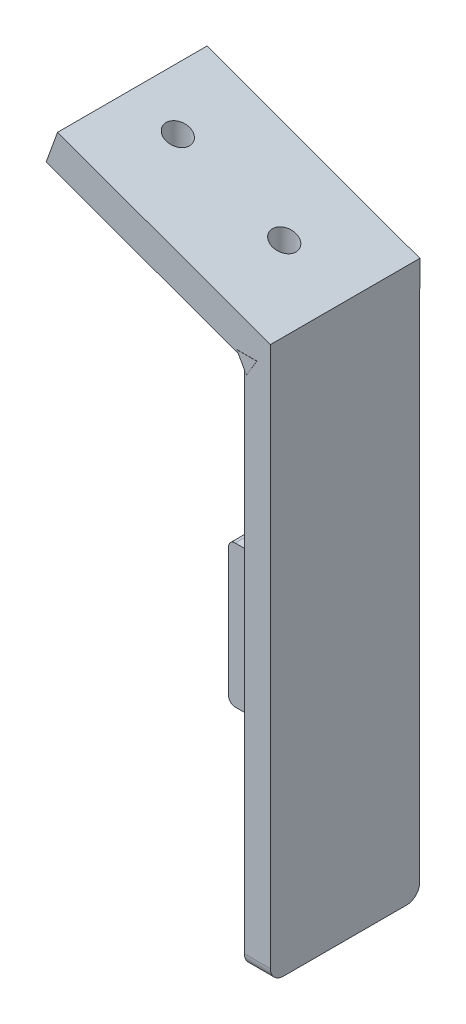
ISO-10303-21;
HEADER;
FILE_DESCRIPTION(('STEP AP214'),'2;1');
FILE_NAME('part.step','',(''),(''),'','','');
FILE_SCHEMA(('AUTOMOTIVE_DESIGN { 1 0 10303 214 1 1 1 1 }'));
ENDSEC;
DATA;
#1=APPLICATION_CONTEXT('core data for automotive mechanical design processes');
#2=APPLICATION_PROTOCOL_DEFINITION('international standard','automotive_design',2000,#1);
#3=PRODUCT_CONTEXT('',#1,'mechanical');
#4=PRODUCT('Part','Part','',(#3));
#5=PRODUCT_RELATED_PRODUCT_CATEGORY('part','',(#4));
#6=PRODUCT_DEFINITION_FORMATION('','',#4);
#7=PRODUCT_DEFINITION_CONTEXT('part definition',#1,'design');
#8=PRODUCT_DEFINITION('design','',#6,#7);
#9=PRODUCT_DEFINITION_SHAPE('','',#8);
#10=(LENGTH_UNIT() NAMED_UNIT(*) SI_UNIT(.MILLI.,.METRE.));
#11=(NAMED_UNIT(*) PLANE_ANGLE_UNIT() SI_UNIT($,.RADIAN.));
#12=(NAMED_UNIT(*) SI_UNIT($,.STERADIAN.) SOLID_ANGLE_UNIT());
#13=UNCERTAINTY_MEASURE_WITH_UNIT(LENGTH_MEASURE(1.E-05),#10,'distance_accuracy_value','');
#14=(GEOMETRIC_REPRESENTATION_CONTEXT(3) GLOBAL_UNCERTAINTY_ASSIGNED_CONTEXT((#13)) GLOBAL_UNIT_ASSIGNED_CONTEXT((#10,
#11,#12)) REPRESENTATION_CONTEXT('',''));
#15=CARTESIAN_POINT('',(0.,0.,0.));
#16=DIRECTION('',(0.,0.,1.));
#17=DIRECTION('',(1.,0.,0.));
#18=AXIS2_PLACEMENT_3D('',#15,#16,#17);
#19=CARTESIAN_POINT('',(-4.,-58.4509756097561,22.93));
#20=DIRECTION('',(1.,0.,0.));
#21=DIRECTION('',(0.,0.,-1.));
#22=AXIS2_PLACEMENT_3D('',#19,#20,#21);
#23=PLANE('',#22);
#24=DIRECTION('',(0.,-1.,0.));
#25=VECTOR('',#24,1.);
#26=CARTESIAN_POINT('',(-4.,12.4645017921239,7.75143133707434));
#27=LINE('',#26,#25);
#28=CARTESIAN_POINT('',(-4.,12.4645017921239,7.75143133707434));
#29=VERTEX_POINT('',#28);
#30=CARTESIAN_POINT('',(-4.,10.4645017921239,7.75143133707434));
#31=VERTEX_POINT('',#30);
#32=EDGE_CURVE('E255',#29,#31,#27,.T.);
#33=ORIENTED_EDGE('',*,*,#32,.F.);
#34=DIRECTION('',(0.,0.,-1.));
#35=VECTOR('',#34,1.);
#36=CARTESIAN_POINT('',(-4.,12.4645017921239,10.7514313370743));
#37=LINE('',#36,#35);
#38=CARTESIAN_POINT('',(-4.,12.4645017921239,10.7514313370743));
#39=VERTEX_POINT('',#38);
#40=EDGE_CURVE('E260',#39,#29,#37,.T.);
#41=ORIENTED_EDGE('',*,*,#40,.F.);
#42=DIRECTION('',(0.,-1.,0.));
#43=VECTOR('',#42,1.);
#44=CARTESIAN_POINT('',(-4.,15.4645017921239,10.7514313370743));
#45=LINE('',#44,#43);
#46=CARTESIAN_POINT('',(-4.,15.4645017921239,10.7514313370743));
#47=VERTEX_POINT('',#46);
#48=EDGE_CURVE('E280',#47,#39,#45,.T.);
#49=ORIENTED_EDGE('',*,*,#48,.F.);
#50=DIRECTION('',(0.,0.,-1.));
#51=VECTOR('',#50,1.);
#52=CARTESIAN_POINT('',(-4.,15.4645017921239,12.7514313370743));
#53=LINE('',#52,#51);
#54=CARTESIAN_POINT('',(-4.,15.4645017921239,12.7514313370743));
#55=VERTEX_POINT('',#54);
#56=EDGE_CURVE('E277',#55,#47,#53,.T.);
#57=ORIENTED_EDGE('',*,*,#56,.F.);
#58=DIRECTION('',(0.,1.,0.));
#59=VECTOR('',#58,1.);
#60=CARTESIAN_POINT('',(-4.,10.4645017921239,12.7514313370743));
#61=LINE('',#60,#59);
#62=CARTESIAN_POINT('',(-4.,10.4645017921239,12.7514313370743));
#63=VERTEX_POINT('',#62);
#64=EDGE_CURVE('E274',#63,#55,#61,.T.);
#65=ORIENTED_EDGE('',*,*,#64,.F.);
#66=DIRECTION('',(0.,0.,1.));
#67=VECTOR('',#66,1.);
#68=CARTESIAN_POINT('',(-4.,10.4645017921239,7.75143133707434));
#69=LINE('',#68,#67);
#70=EDGE_CURVE('E60',#31,#63,#69,.T.);
#71=ORIENTED_EDGE('',*,*,#70,.F.);
#72=EDGE_LOOP('',(#33,#41,#49,#57,#65,#71));
#73=FACE_BOUND('',#72,.T.);
#74=DIRECTION('',(0.,0.,1.));
#75=VECTOR('',#74,1.);
#76=CARTESIAN_POINT('',(-4.,21.2877543682845,22.93));
#77=LINE('',#76,#75);
#78=CARTESIAN_POINT('',(-3.99999999999997,21.2877543682844,0.));
#79=VERTEX_POINT('',#78);
#80=CARTESIAN_POINT('',(-3.99999999999999,21.2877543682844,22.93));
#81=VERTEX_POINT('',#80);
#82=EDGE_CURVE('E251',#79,#81,#77,.T.);
#83=ORIENTED_EDGE('',*,*,#82,.F.);
#84=DIRECTION('',(0.,-1.,0.));
#85=VECTOR('',#84,1.);
#86=CARTESIAN_POINT('',(-4.,-58.4509756097561,0.));
#87=LINE('',#86,#85);
#88=CARTESIAN_POINT('',(-4.,-22.4709756097561,0.));
#89=VERTEX_POINT('',#88);
#90=EDGE_CURVE('E368',#79,#89,#87,.T.);
#91=ORIENTED_EDGE('',*,*,#90,.T.);
#92=CARTESIAN_POINT('',(-4.,-22.4709756097561,1.));
#93=DIRECTION('',(1.,0.,0.));
#94=DIRECTION('',(0.,0.,-1.));
#95=AXIS2_PLACEMENT_3D('',#92,#93,#94);
#96=CIRCLE('',#95,1.);
#97=CARTESIAN_POINT('',(-4.,-21.4709756097561,1.));
#98=VERTEX_POINT('',#97);
#99=EDGE_CURVE('E435',#89,#98,#96,.T.);
#100=ORIENTED_EDGE('',*,*,#99,.T.);
#101=DIRECTION('',(0.,0.,1.));
#102=VECTOR('',#101,1.);
#103=CARTESIAN_POINT('',(-4.,-21.4709756097561,22.93));
#104=LINE('',#103,#102);
#105=CARTESIAN_POINT('',(-4.,-21.4709756097561,4.));
#106=VERTEX_POINT('',#105);
#107=EDGE_CURVE('E317',#98,#106,#104,.T.);
#108=ORIENTED_EDGE('',*,*,#107,.T.);
#109=DIRECTION('',(0.,-1.,0.));
#110=VECTOR('',#109,1.);
#111=CARTESIAN_POINT('',(-4.,-58.4509756097561,4.));
#112=LINE('',#111,#110);
#113=CARTESIAN_POINT('',(-4.,-43.2913286370677,4.));
#114=VERTEX_POINT('',#113);
#115=EDGE_CURVE('E324',#106,#114,#112,.T.);
#116=ORIENTED_EDGE('',*,*,#115,.T.);
#117=DIRECTION('',(0.,0.,-1.));
#118=VECTOR('',#117,1.);
#119=CARTESIAN_POINT('',(-4.,-43.2913286370677,22.93));
#120=LINE('',#119,#118);
#121=CARTESIAN_POINT('',(-4.,-43.2913286370677,1.));
#122=VERTEX_POINT('',#121);
#123=EDGE_CURVE('E321',#114,#122,#120,.T.);
#124=ORIENTED_EDGE('',*,*,#123,.T.);
#125=CARTESIAN_POINT('',(-4.,-42.2913286370677,1.));
#126=DIRECTION('',(1.,0.,0.));
#127=DIRECTION('',(0.,0.,-1.));
#128=AXIS2_PLACEMENT_3D('',#125,#126,#127);
#129=CIRCLE('',#128,1.);
#130=CARTESIAN_POINT('',(-4.,-42.2913286370677,0.));
#131=VERTEX_POINT('',#130);
#132=EDGE_CURVE('E432',#122,#131,#129,.T.);
#133=ORIENTED_EDGE('',*,*,#132,.T.);
#134=CARTESIAN_POINT('',(-4.,-56.4509756097561,0.));
#135=VERTEX_POINT('',#134);
#136=EDGE_CURVE('E355',#131,#135,#87,.T.);
#137=ORIENTED_EDGE('',*,*,#136,.T.);
#138=CARTESIAN_POINT('',(-4.,-56.4509756097561,2.));
#139=DIRECTION('',(1.,0.,0.));
#140=DIRECTION('',(0.,0.,-1.));
#141=AXIS2_PLACEMENT_3D('',#138,#139,#140);
#142=CIRCLE('',#141,2.);
#143=CARTESIAN_POINT('',(-4.,-58.4509756097561,2.));
#144=VERTEX_POINT('',#143);
#145=EDGE_CURVE('E392',#135,#144,#142,.F.);
#146=ORIENTED_EDGE('',*,*,#145,.T.);
#147=DIRECTION('',(0.,0.,-1.));
#148=VECTOR('',#147,1.);
#149=CARTESIAN_POINT('',(-4.,-58.4509756097561,22.93));
#150=LINE('',#149,#148);
#151=CARTESIAN_POINT('',(-4.,-58.4509756097561,20.93));
#152=VERTEX_POINT('',#151);
#153=EDGE_CURVE('E375',#152,#144,#150,.T.);
#154=ORIENTED_EDGE('',*,*,#153,.F.);
#155=CARTESIAN_POINT('',(-4.,-56.4509756097561,20.93));
#156=DIRECTION('',(1.,0.,0.));
#157=DIRECTION('',(0.,0.,-1.));
#158=AXIS2_PLACEMENT_3D('',#155,#156,#157);
#159=CIRCLE('',#158,2.);
#160=CARTESIAN_POINT('',(-4.,-56.4509756097561,22.93));
#161=VERTEX_POINT('',#160);
#162=EDGE_CURVE('E394',#152,#161,#159,.F.);
#163=ORIENTED_EDGE('',*,*,#162,.T.);
#164=DIRECTION('',(0.,-1.,0.));
#165=VECTOR('',#164,1.);
#166=CARTESIAN_POINT('',(-4.,-58.4509756097561,22.93));
#167=LINE('',#166,#165);
#168=EDGE_CURVE('E362',#81,#161,#167,.T.);
#169=ORIENTED_EDGE('',*,*,#168,.F.);
#170=EDGE_LOOP('',(#83,#91,#100,#108,#116,#124,#133,#137,#146,#154,#163,#169));
#171=FACE_BOUND('',#170,.T.);
#172=ADVANCED_FACE('F37',(#73,#171),#23,.F.);
#173=CARTESIAN_POINT('',(0.,0.,22.93));
#174=DIRECTION('',(0.,0.,-1.));
#175=DIRECTION('',(-1.,0.,0.));
#176=AXIS2_PLACEMENT_3D('',#173,#174,#175);
#177=PLANE('',#176);
#178=DIRECTION('',(0.493012571980879,-0.870022185848613,0.));
#179=VECTOR('',#178,1.);
#180=CARTESIAN_POINT('',(6.10324199144245,3.45850379515071,22.93));
#181=LINE('',#180,#179);
#182=CARTESIAN_POINT('',(-5.15196674366272,23.3206368571011,22.93));
#183=VERTEX_POINT('',#182);
#184=CARTESIAN_POINT('',(-4.90043401385705,22.8767555692087,22.93));
#185=VERTEX_POINT('',#184);
#186=EDGE_CURVE('E243',#183,#185,#181,.T.);
#187=ORIENTED_EDGE('',*,*,#186,.F.);
#188=DIRECTION('',(-1.,0.,0.));
#189=VECTOR('',#188,1.);
#190=CARTESIAN_POINT('',(0.,23.3206368571011,22.93));
#191=LINE('',#190,#189);
#192=CARTESIAN_POINT('',(-2.075100002577,23.3206368571011,22.93));
#193=VERTEX_POINT('',#192);
#194=EDGE_CURVE('E11',#193,#183,#191,.T.);
#195=ORIENTED_EDGE('',*,*,#194,.F.);
#196=DIRECTION('',(0.513877207737596,0.857863751051303,0.));
#197=VECTOR('',#196,1.);
#198=CARTESIAN_POINT('',(-11.8077197302464,7.0730556423339,22.93));
#199=LINE('',#198,#197);
#200=CARTESIAN_POINT('',(-3.65623169206681,20.6811044131083,22.93));
#201=VERTEX_POINT('',#200);
#202=EDGE_CURVE('E253',#201,#193,#199,.T.);
#203=ORIENTED_EDGE('',*,*,#202,.F.);
#204=EDGE_CURVE('E245',#81,#201,#181,.T.);
#205=ORIENTED_EDGE('',*,*,#204,.F.);
#206=ORIENTED_EDGE('',*,*,#168,.T.);
#207=DIRECTION('',(1.,0.,0.));
#208=VECTOR('',#207,1.);
#209=CARTESIAN_POINT('',(0.,-56.4509756097561,22.93));
#210=LINE('',#209,#208);
#211=CARTESIAN_POINT('',(0.,-56.4509756097561,22.93));
#212=VERTEX_POINT('',#211);
#213=EDGE_CURVE('E380',#161,#212,#210,.T.);
#214=ORIENTED_EDGE('',*,*,#213,.T.);
#215=DIRECTION('',(0.,1.,0.));
#216=VECTOR('',#215,1.);
#217=CARTESIAN_POINT('',(0.,26.5490243902439,22.93));
#218=LINE('',#217,#216);
#219=CARTESIAN_POINT('',(0.,26.5490243902439,22.93));
#220=VERTEX_POINT('',#219);
#221=EDGE_CURVE('E364',#212,#220,#218,.T.);
#222=ORIENTED_EDGE('',*,*,#221,.T.);
#223=DIRECTION('',(-0.93969262078591,0.342020143325664,0.));
#224=VECTOR('',#223,1.);
#225=CARTESIAN_POINT('',(-32.6819352806682,38.4442760306214,22.93));
#226=LINE('',#225,#224);
#227=CARTESIAN_POINT('',(-32.6819352806682,38.4442760306214,22.93));
#228=VERTEX_POINT('',#227);
#229=EDGE_CURVE('E327',#220,#228,#226,.T.);
#230=ORIENTED_EDGE('',*,*,#229,.T.);
#231=DIRECTION('',(-0.342020143325664,-0.93969262078591,0.));
#232=VECTOR('',#231,1.);
#233=CARTESIAN_POINT('',(-34.4354216138033,33.6266119250103,22.93));
#234=LINE('',#233,#232);
#235=CARTESIAN_POINT('',(-34.4354216138033,33.6266119250103,22.93));
#236=VERTEX_POINT('',#235);
#237=EDGE_CURVE('E347',#228,#236,#234,.T.);
#238=ORIENTED_EDGE('',*,*,#237,.T.);
#239=DIRECTION('',(0.93969262078591,-0.342020143325664,0.));
#240=VECTOR('',#239,1.);
#241=CARTESIAN_POINT('',(-4.,22.5490243902439,22.93));
#242=LINE('',#241,#240);
#243=EDGE_CURVE('E332',#236,#185,#242,.T.);
#244=ORIENTED_EDGE('',*,*,#243,.T.);
#245=EDGE_LOOP('',(#187,#195,#203,#205,#206,#214,#222,#230,#238,#244));
#246=FACE_BOUND('',#245,.T.);
#247=ADVANCED_FACE('F457',(#246),#177,.F.);
#248=CARTESIAN_POINT('',(-4.,22.5490243902439,-0.0199999999999992));
#249=DIRECTION('',(-0.342020143325664,-0.93969262078591,0.));
#250=DIRECTION('',(0.93969262078591,-0.342020143325664,0.));
#251=AXIS2_PLACEMENT_3D('',#248,#249,#250);
#252=PLANE('',#251);
#253=CARTESIAN_POINT('',(-25.7301761499132,30.4581616941735,11.4161993039032));
#254=DIRECTION('',(-0.342020143325664,-0.93969262078591,0.));
#255=DIRECTION('',(0.93969262078591,-0.342020143325664,0.));
#256=AXIS2_PLACEMENT_3D('',#253,#254,#255);
#257=ELLIPSE('',#256,1.91551999045664,1.8);
#258=CARTESIAN_POINT('',(-23.9301761499132,29.8030152724944,11.4161993039032));
#259=VERTEX_POINT('',#258);
#260=EDGE_CURVE('E306',#259,#259,#257,.F.);
#261=ORIENTED_EDGE('',*,*,#260,.T.);
#262=EDGE_LOOP('',(#261));
#263=FACE_BOUND('',#262,.T.);
#264=CARTESIAN_POINT('',(-9.38920850957913,24.5105358739848,11.4161993039032));
#265=DIRECTION('',(-0.342020143325664,-0.93969262078591,0.));
#266=DIRECTION('',(0.93969262078591,-0.342020143325664,0.));
#267=AXIS2_PLACEMENT_3D('',#264,#265,#266);
#268=ELLIPSE('',#267,1.91551999045664,1.8);
#269=CARTESIAN_POINT('',(-7.58920850957913,23.8553894523056,11.4161993039032));
#270=VERTEX_POINT('',#269);
#271=EDGE_CURVE('E302',#270,#270,#268,.F.);
#272=ORIENTED_EDGE('',*,*,#271,.T.);
#273=EDGE_LOOP('',(#272));
#274=FACE_BOUND('',#273,.T.);
#275=DIRECTION('',(-0.93969262078591,0.342020143325664,0.));
#276=VECTOR('',#275,1.);
#277=CARTESIAN_POINT('',(-4.,22.5490243902439,0.));
#278=LINE('',#277,#276);
#279=CARTESIAN_POINT('',(-4.,22.5490243902439,0.));
#280=VERTEX_POINT('',#279);
#281=CARTESIAN_POINT('',(-4.90043401385705,22.8767555692087,0.));
#282=VERTEX_POINT('',#281);
#283=EDGE_CURVE('E437',#280,#282,#278,.T.);
#284=ORIENTED_EDGE('',*,*,#283,.T.);
#285=DIRECTION('',(0.,0.,1.));
#286=VECTOR('',#285,1.);
#287=CARTESIAN_POINT('',(-4.90043401385705,22.8767555692087,-0.0199999999999992));
#288=LINE('',#287,#286);
#289=EDGE_CURVE('E45',#282,#185,#288,.T.);
#290=ORIENTED_EDGE('',*,*,#289,.T.);
#291=ORIENTED_EDGE('',*,*,#243,.F.);
#292=DIRECTION('',(0.,0.,1.));
#293=VECTOR('',#292,1.);
#294=CARTESIAN_POINT('',(-34.4354216138033,33.6266119250103,-0.0199999999999992));
#295=LINE('',#294,#293);
#296=CARTESIAN_POINT('',(-34.4354216138033,33.6266119250103,-0.0199999999999992));
#297=VERTEX_POINT('',#296);
#298=EDGE_CURVE('E359',#297,#236,#295,.T.);
#299=ORIENTED_EDGE('',*,*,#298,.F.);
#300=DIRECTION('',(0.93969262078591,-0.342020143325664,0.));
#301=VECTOR('',#300,1.);
#302=CARTESIAN_POINT('',(-4.,22.5490243902439,-0.0199999999999992));
#303=LINE('',#302,#301);
#304=CARTESIAN_POINT('',(-4.,22.5490243902439,-0.0199999999999992));
#305=VERTEX_POINT('',#304);
#306=EDGE_CURVE('E338',#297,#305,#303,.T.);
#307=ORIENTED_EDGE('',*,*,#306,.T.);
#308=DIRECTION('',(0.,0.,1.));
#309=VECTOR('',#308,1.);
#310=CARTESIAN_POINT('',(-4.,22.5490243902439,-0.0199999999999992));
#311=LINE('',#310,#309);
#312=EDGE_CURVE('E356',#305,#280,#311,.T.);
#313=ORIENTED_EDGE('',*,*,#312,.T.);
#314=EDGE_LOOP('',(#284,#290,#291,#299,#307,#313));
#315=FACE_BOUND('',#314,.T.);
#316=ADVANCED_FACE('F455',(#263,#274,#315),#252,.T.);
#317=CARTESIAN_POINT('',(0.,-58.4509756097561,22.93));
#318=DIRECTION('',(0.,1.,0.));
#319=DIRECTION('',(0.,0.,1.));
#320=AXIS2_PLACEMENT_3D('',#317,#318,#319);
#321=PLANE('',#320);
#322=DIRECTION('',(0.,0.,-1.));
#323=VECTOR('',#322,1.);
#324=CARTESIAN_POINT('',(0.,-58.4509756097561,22.93));
#325=LINE('',#324,#323);
#326=CARTESIAN_POINT('',(0.,-58.4509756097561,20.93));
#327=VERTEX_POINT('',#326);
#328=CARTESIAN_POINT('',(0.,-58.4509756097561,2.));
#329=VERTEX_POINT('',#328);
#330=EDGE_CURVE('E372',#327,#329,#325,.T.);
#331=ORIENTED_EDGE('',*,*,#330,.F.);
#332=DIRECTION('',(1.,0.,0.));
#333=VECTOR('',#332,1.);
#334=CARTESIAN_POINT('',(0.,-58.4509756097561,20.93));
#335=LINE('',#334,#333);
#336=EDGE_CURVE('E390',#327,#152,#335,.F.);
#337=ORIENTED_EDGE('',*,*,#336,.T.);
#338=ORIENTED_EDGE('',*,*,#153,.T.);
#339=DIRECTION('',(1.,0.,0.));
#340=VECTOR('',#339,1.);
#341=CARTESIAN_POINT('',(0.,-58.4509756097561,2.));
#342=LINE('',#341,#340);
#343=EDGE_CURVE('E387',#144,#329,#342,.T.);
#344=ORIENTED_EDGE('',*,*,#343,.T.);
#345=EDGE_LOOP('',(#331,#337,#338,#344));
#346=FACE_BOUND('',#345,.T.);
#347=ADVANCED_FACE('F484',(#346),#321,.F.);
#348=CARTESIAN_POINT('',(0.,26.5490243902439,22.93));
#349=DIRECTION('',(-1.,0.,0.));
#350=DIRECTION('',(0.,-1.,0.));
#351=AXIS2_PLACEMENT_3D('',#348,#349,#350);
#352=PLANE('',#351);
#353=DIRECTION('',(0.,1.,0.));
#354=VECTOR('',#353,1.);
#355=CARTESIAN_POINT('',(0.,26.5490243902439,0.));
#356=LINE('',#355,#354);
#357=CARTESIAN_POINT('',(0.,-56.4509756097561,0.));
#358=VERTEX_POINT('',#357);
#359=CARTESIAN_POINT('',(0.,22.5490243902439,0.));
#360=VERTEX_POINT('',#359);
#361=EDGE_CURVE('E365',#358,#360,#356,.T.);
#362=ORIENTED_EDGE('',*,*,#361,.T.);
#363=DIRECTION('',(0.,0.,1.));
#364=VECTOR('',#363,1.);
#365=CARTESIAN_POINT('',(0.,22.5490243902439,-0.0199999999999992));
#366=LINE('',#365,#364);
#367=CARTESIAN_POINT('',(0.,22.5490243902439,-0.0199999999999992));
#368=VERTEX_POINT('',#367);
#369=EDGE_CURVE('E352',#368,#360,#366,.T.);
#370=ORIENTED_EDGE('',*,*,#369,.F.);
#371=DIRECTION('',(0.,1.,0.));
#372=VECTOR('',#371,1.);
#373=CARTESIAN_POINT('',(0.,26.5490243902439,-0.0199999999999992));
#374=LINE('',#373,#372);
#375=CARTESIAN_POINT('',(0.,26.5490243902439,-0.0199999999999992));
#376=VERTEX_POINT('',#375);
#377=EDGE_CURVE('E328',#368,#376,#374,.T.);
#378=ORIENTED_EDGE('',*,*,#377,.T.);
#379=DIRECTION('',(0.,0.,-1.));
#380=VECTOR('',#379,1.);
#381=CARTESIAN_POINT('',(0.,26.5490243902439,22.93));
#382=LINE('',#381,#380);
#383=EDGE_CURVE('E367',#220,#376,#382,.T.);
#384=ORIENTED_EDGE('',*,*,#383,.F.);
#385=ORIENTED_EDGE('',*,*,#221,.F.);
#386=CARTESIAN_POINT('',(0.,-56.4509756097561,20.93));
#387=DIRECTION('',(-1.,0.,0.));
#388=DIRECTION('',(0.,-1.,0.));
#389=AXIS2_PLACEMENT_3D('',#386,#387,#388);
#390=CIRCLE('',#389,2.);
#391=EDGE_CURVE('E385',#212,#327,#390,.F.);
#392=ORIENTED_EDGE('',*,*,#391,.T.);
#393=ORIENTED_EDGE('',*,*,#330,.T.);
#394=CARTESIAN_POINT('',(0.,-56.4509756097561,2.));
#395=DIRECTION('',(-1.,0.,0.));
#396=DIRECTION('',(0.,-1.,0.));
#397=AXIS2_PLACEMENT_3D('',#394,#395,#396);
#398=CIRCLE('',#397,2.);
#399=EDGE_CURVE('E383',#329,#358,#398,.F.);
#400=ORIENTED_EDGE('',*,*,#399,.T.);
#401=EDGE_LOOP('',(#362,#370,#378,#384,#385,#392,#393,#400));
#402=FACE_BOUND('',#401,.T.);
#403=ADVANCED_FACE('F475',(#402),#352,.F.);
#404=CARTESIAN_POINT('',(0.,0.,0.));
#405=DIRECTION('',(0.,0.,-1.));
#406=DIRECTION('',(-1.,0.,0.));
#407=AXIS2_PLACEMENT_3D('',#404,#405,#406);
#408=PLANE('',#407);
#409=ORIENTED_EDGE('',*,*,#90,.F.);
#410=DIRECTION('',(0.493012571980879,-0.870022185848613,0.));
#411=VECTOR('',#410,1.);
#412=CARTESIAN_POINT('',(-5.15196674366272,23.3206368571011,0.));
#413=LINE('',#412,#411);
#414=EDGE_CURVE('E52',#282,#79,#413,.T.);
#415=ORIENTED_EDGE('',*,*,#414,.F.);
#416=ORIENTED_EDGE('',*,*,#283,.F.);
#417=DIRECTION('',(-1.,0.,0.));
#418=VECTOR('',#417,1.);
#419=CARTESIAN_POINT('',(0.,22.5490243902439,0.));
#420=LINE('',#419,#418);
#421=EDGE_CURVE('E378',#360,#280,#420,.T.);
#422=ORIENTED_EDGE('',*,*,#421,.F.);
#423=ORIENTED_EDGE('',*,*,#361,.F.);
#424=DIRECTION('',(1.,0.,0.));
#425=VECTOR('',#424,1.);
#426=CARTESIAN_POINT('',(-4.,-56.4509756097561,0.));
#427=LINE('',#426,#425);
#428=EDGE_CURVE('E397',#358,#135,#427,.F.);
#429=ORIENTED_EDGE('',*,*,#428,.T.);
#430=ORIENTED_EDGE('',*,*,#136,.F.);
#431=DIRECTION('',(1.,0.,0.));
#432=VECTOR('',#431,1.);
#433=CARTESIAN_POINT('',(0.,-42.2913286370677,0.));
#434=LINE('',#433,#432);
#435=CARTESIAN_POINT('',(-24.35,-42.2913286370677,0.));
#436=VERTEX_POINT('',#435);
#437=EDGE_CURVE('E422',#131,#436,#434,.F.);
#438=ORIENTED_EDGE('',*,*,#437,.T.);
#439=DIRECTION('',(0.,1.,0.));
#440=VECTOR('',#439,1.);
#441=CARTESIAN_POINT('',(-24.35,0.,0.));
#442=LINE('',#441,#440);
#443=CARTESIAN_POINT('',(-24.35,-22.4709756097561,0.));
#444=VERTEX_POINT('',#443);
#445=EDGE_CURVE('E420',#436,#444,#442,.T.);
#446=ORIENTED_EDGE('',*,*,#445,.T.);
#447=DIRECTION('',(1.,0.,0.));
#448=VECTOR('',#447,1.);
#449=CARTESIAN_POINT('',(0.,-22.4709756097561,0.));
#450=LINE('',#449,#448);
#451=EDGE_CURVE('E417',#444,#89,#450,.T.);
#452=ORIENTED_EDGE('',*,*,#451,.T.);
#453=EDGE_LOOP('',(#409,#415,#416,#422,#423,#429,#430,#438,#446,#452));
#454=FACE_BOUND('',#453,.T.);
#455=ADVANCED_FACE('F473',(#454),#408,.T.);
#456=CARTESIAN_POINT('',(0.,22.5490243902439,-0.0199999999999992));
#457=DIRECTION('',(0.,-1.,0.));
#458=DIRECTION('',(0.,0.,-1.));
#459=AXIS2_PLACEMENT_3D('',#456,#457,#458);
#460=PLANE('',#459);
#461=ORIENTED_EDGE('',*,*,#369,.T.);
#462=ORIENTED_EDGE('',*,*,#421,.T.);
#463=ORIENTED_EDGE('',*,*,#312,.F.);
#464=DIRECTION('',(1.,0.,0.));
#465=VECTOR('',#464,1.);
#466=CARTESIAN_POINT('',(0.,22.5490243902439,-0.0199999999999992));
#467=LINE('',#466,#465);
#468=EDGE_CURVE('E341',#305,#368,#467,.T.);
#469=ORIENTED_EDGE('',*,*,#468,.T.);
#470=EDGE_LOOP('',(#461,#462,#463,#469));
#471=FACE_BOUND('',#470,.T.);
#472=ADVANCED_FACE('F470',(#471),#460,.T.);
#473=CARTESIAN_POINT('',(-34.4354216138033,33.6266119250103,-0.0199999999999992));
#474=DIRECTION('',(-0.93969262078591,0.342020143325664,0.));
#475=DIRECTION('',(-0.342020143325664,-0.93969262078591,0.));
#476=AXIS2_PLACEMENT_3D('',#473,#474,#475);
#477=PLANE('',#476);
#478=ORIENTED_EDGE('',*,*,#237,.F.);
#479=DIRECTION('',(0.,0.,1.));
#480=VECTOR('',#479,1.);
#481=CARTESIAN_POINT('',(-32.6819352806682,38.4442760306214,-0.0199999999999992));
#482=LINE('',#481,#480);
#483=CARTESIAN_POINT('',(-32.6819352806682,38.4442760306214,-0.0199999999999992));
#484=VERTEX_POINT('',#483);
#485=EDGE_CURVE('E344',#484,#228,#482,.T.);
#486=ORIENTED_EDGE('',*,*,#485,.F.);
#487=DIRECTION('',(-0.342020143325664,-0.93969262078591,0.));
#488=VECTOR('',#487,1.);
#489=CARTESIAN_POINT('',(-34.4354216138033,33.6266119250103,-0.0199999999999992));
#490=LINE('',#489,#488);
#491=EDGE_CURVE('E335',#484,#297,#490,.T.);
#492=ORIENTED_EDGE('',*,*,#491,.T.);
#493=ORIENTED_EDGE('',*,*,#298,.T.);
#494=EDGE_LOOP('',(#478,#486,#492,#493));
#495=FACE_BOUND('',#494,.T.);
#496=ADVANCED_FACE('F461',(#495),#477,.T.);
#497=CARTESIAN_POINT('',(-32.6819352806682,38.4442760306214,-0.0199999999999992));
#498=DIRECTION('',(0.342020143325664,0.93969262078591,0.));
#499=DIRECTION('',(-0.93969262078591,0.342020143325664,0.));
#500=AXIS2_PLACEMENT_3D('',#497,#498,#499);
#501=PLANE('',#500);
#502=CARTESIAN_POINT('',(-25.7301761499132,35.9140426312383,11.4161993039032));
#503=DIRECTION('',(0.342020143325664,0.93969262078591,0.));
#504=DIRECTION('',(0.93969262078591,-0.342020143325664,0.));
#505=AXIS2_PLACEMENT_3D('',#502,#503,#504);
#506=ELLIPSE('',#505,1.91551999045664,1.8);
#507=CARTESIAN_POINT('',(-23.9301761499132,35.2588962095592,11.4161993039032));
#508=VERTEX_POINT('',#507);
#509=EDGE_CURVE('E305',#508,#508,#506,.F.);
#510=ORIENTED_EDGE('',*,*,#509,.T.);
#511=EDGE_LOOP('',(#510));
#512=FACE_BOUND('',#511,.T.);
#513=CARTESIAN_POINT('',(-9.38920850957913,29.9664168110496,11.4161993039032));
#514=DIRECTION('',(0.342020143325664,0.93969262078591,0.));
#515=DIRECTION('',(0.93969262078591,-0.342020143325664,0.));
#516=AXIS2_PLACEMENT_3D('',#513,#514,#515);
#517=ELLIPSE('',#516,1.91551999045664,1.8);
#518=CARTESIAN_POINT('',(-7.58920850957913,29.3112703893704,11.4161993039032));
#519=VERTEX_POINT('',#518);
#520=EDGE_CURVE('E301',#519,#519,#517,.F.);
#521=ORIENTED_EDGE('',*,*,#520,.T.);
#522=EDGE_LOOP('',(#521));
#523=FACE_BOUND('',#522,.T.);
#524=ORIENTED_EDGE('',*,*,#229,.F.);
#525=ORIENTED_EDGE('',*,*,#383,.T.);
#526=DIRECTION('',(-0.93969262078591,0.342020143325664,0.));
#527=VECTOR('',#526,1.);
#528=CARTESIAN_POINT('',(-32.6819352806682,38.4442760306214,-0.0199999999999992));
#529=LINE('',#528,#527);
#530=EDGE_CURVE('E331',#376,#484,#529,.T.);
#531=ORIENTED_EDGE('',*,*,#530,.T.);
#532=ORIENTED_EDGE('',*,*,#485,.T.);
#533=EDGE_LOOP('',(#524,#525,#531,#532));
#534=FACE_BOUND('',#533,.T.);
#535=ADVANCED_FACE('F638',(#512,#523,#534),#501,.T.);
#536=CARTESIAN_POINT('',(0.,0.,-0.0199999999999992));
#537=DIRECTION('',(0.,0.,-1.));
#538=DIRECTION('',(-1.,0.,0.));
#539=AXIS2_PLACEMENT_3D('',#536,#537,#538);
#540=PLANE('',#539);
#541=ORIENTED_EDGE('',*,*,#377,.F.);
#542=ORIENTED_EDGE('',*,*,#468,.F.);
#543=ORIENTED_EDGE('',*,*,#306,.F.);
#544=ORIENTED_EDGE('',*,*,#491,.F.);
#545=ORIENTED_EDGE('',*,*,#530,.F.);
#546=EDGE_LOOP('',(#541,#542,#543,#544,#545));
#547=FACE_BOUND('',#546,.T.);
#548=ADVANCED_FACE('F467',(#547),#540,.T.);
#549=CARTESIAN_POINT('',(0.,-56.4509756097561,20.93));
#550=DIRECTION('',(1.,0.,0.));
#551=DIRECTION('',(0.,0.,-1.));
#552=AXIS2_PLACEMENT_3D('',#549,#550,#551);
#553=CYLINDRICAL_SURFACE('',#552,2.);
#554=ORIENTED_EDGE('',*,*,#162,.F.);
#555=ORIENTED_EDGE('',*,*,#336,.F.);
#556=ORIENTED_EDGE('',*,*,#391,.F.);
#557=ORIENTED_EDGE('',*,*,#213,.F.);
#558=EDGE_LOOP('',(#554,#555,#556,#557));
#559=FACE_BOUND('',#558,.T.);
#560=ADVANCED_FACE('F497',(#559),#553,.T.);
#561=CARTESIAN_POINT('',(0.,-56.4509756097561,2.));
#562=DIRECTION('',(-1.,0.,0.));
#563=DIRECTION('',(0.,0.,1.));
#564=AXIS2_PLACEMENT_3D('',#561,#562,#563);
#565=CYLINDRICAL_SURFACE('',#564,2.);
#566=ORIENTED_EDGE('',*,*,#145,.F.);
#567=ORIENTED_EDGE('',*,*,#428,.F.);
#568=ORIENTED_EDGE('',*,*,#399,.F.);
#569=ORIENTED_EDGE('',*,*,#343,.F.);
#570=EDGE_LOOP('',(#566,#567,#568,#569));
#571=FACE_BOUND('',#570,.T.);
#572=ADVANCED_FACE('F500',(#571),#565,.T.);
#573=CARTESIAN_POINT('',(-25.35,-43.2913286370677,4.));
#574=DIRECTION('',(0.,0.,1.));
#575=DIRECTION('',(1.,0.,0.));
#576=AXIS2_PLACEMENT_3D('',#573,#574,#575);
#577=PLANE('',#576);
#578=DIRECTION('',(0.,-1.,0.));
#579=VECTOR('',#578,1.);
#580=CARTESIAN_POINT('',(-25.35,-43.2913286370677,4.));
#581=LINE('',#580,#579);
#582=CARTESIAN_POINT('',(-25.35,-22.4709756097561,4.));
#583=VERTEX_POINT('',#582);
#584=CARTESIAN_POINT('',(-25.35,-42.2913286370677,4.));
#585=VERTEX_POINT('',#584);
#586=EDGE_CURVE('E310',#583,#585,#581,.T.);
#587=ORIENTED_EDGE('',*,*,#586,.T.);
#588=CARTESIAN_POINT('',(-24.35,-42.2913286370677,4.));
#589=DIRECTION('',(0.,0.,1.));
#590=DIRECTION('',(1.,0.,0.));
#591=AXIS2_PLACEMENT_3D('',#588,#589,#590);
#592=CIRCLE('',#591,1.);
#593=CARTESIAN_POINT('',(-24.35,-43.2913286370677,4.));
#594=VERTEX_POINT('',#593);
#595=EDGE_CURVE('E410',#585,#594,#592,.T.);
#596=ORIENTED_EDGE('',*,*,#595,.T.);
#597=DIRECTION('',(1.,0.,0.));
#598=VECTOR('',#597,1.);
#599=CARTESIAN_POINT('',(-25.35,-43.2913286370677,4.));
#600=LINE('',#599,#598);
#601=EDGE_CURVE('E315',#594,#114,#600,.T.);
#602=ORIENTED_EDGE('',*,*,#601,.T.);
#603=ORIENTED_EDGE('',*,*,#115,.F.);
#604=DIRECTION('',(1.,0.,0.));
#605=VECTOR('',#604,1.);
#606=CARTESIAN_POINT('',(-25.35,-21.4709756097561,4.));
#607=LINE('',#606,#605);
#608=CARTESIAN_POINT('',(-24.35,-21.4709756097561,4.));
#609=VERTEX_POINT('',#608);
#610=EDGE_CURVE('E313',#609,#106,#607,.T.);
#611=ORIENTED_EDGE('',*,*,#610,.F.);
#612=CARTESIAN_POINT('',(-24.35,-22.4709756097561,4.));
#613=DIRECTION('',(0.,0.,1.));
#614=DIRECTION('',(1.,0.,0.));
#615=AXIS2_PLACEMENT_3D('',#612,#613,#614);
#616=CIRCLE('',#615,1.);
#617=EDGE_CURVE('E408',#609,#583,#616,.T.);
#618=ORIENTED_EDGE('',*,*,#617,.T.);
#619=EDGE_LOOP('',(#587,#596,#602,#603,#611,#618));
#620=FACE_BOUND('',#619,.T.);
#621=ADVANCED_FACE('F504',(#620),#577,.T.);
#622=CARTESIAN_POINT('',(-25.35,-43.2913286370677,0.));
#623=DIRECTION('',(0.,-1.,0.));
#624=DIRECTION('',(0.,0.,-1.));
#625=AXIS2_PLACEMENT_3D('',#622,#623,#624);
#626=PLANE('',#625);
#627=DIRECTION('',(0.,0.,-1.));
#628=VECTOR('',#627,1.);
#629=CARTESIAN_POINT('',(-24.35,-43.2913286370677,0.));
#630=LINE('',#629,#628);
#631=CARTESIAN_POINT('',(-24.35,-43.2913286370677,1.));
#632=VERTEX_POINT('',#631);
#633=EDGE_CURVE('E400',#594,#632,#630,.T.);
#634=ORIENTED_EDGE('',*,*,#633,.T.);
#635=DIRECTION('',(1.,0.,0.));
#636=VECTOR('',#635,1.);
#637=CARTESIAN_POINT('',(-25.35,-43.2913286370677,1.));
#638=LINE('',#637,#636);
#639=EDGE_CURVE('E428',#632,#122,#638,.T.);
#640=ORIENTED_EDGE('',*,*,#639,.T.);
#641=ORIENTED_EDGE('',*,*,#123,.F.);
#642=ORIENTED_EDGE('',*,*,#601,.F.);
#643=EDGE_LOOP('',(#634,#640,#641,#642));
#644=FACE_BOUND('',#643,.T.);
#645=ADVANCED_FACE('F551',(#644),#626,.T.);
#646=CARTESIAN_POINT('',(-25.35,-21.4709756097561,4.));
#647=DIRECTION('',(0.,1.,0.));
#648=DIRECTION('',(0.,0.,1.));
#649=AXIS2_PLACEMENT_3D('',#646,#647,#648);
#650=PLANE('',#649);
#651=ORIENTED_EDGE('',*,*,#107,.F.);
#652=DIRECTION('',(1.,0.,0.));
#653=VECTOR('',#652,1.);
#654=CARTESIAN_POINT('',(-25.35,-21.4709756097561,1.));
#655=LINE('',#654,#653);
#656=CARTESIAN_POINT('',(-24.35,-21.4709756097561,1.));
#657=VERTEX_POINT('',#656);
#658=EDGE_CURVE('E430',#98,#657,#655,.F.);
#659=ORIENTED_EDGE('',*,*,#658,.T.);
#660=DIRECTION('',(0.,0.,1.));
#661=VECTOR('',#660,1.);
#662=CARTESIAN_POINT('',(-24.35,-21.4709756097561,4.));
#663=LINE('',#662,#661);
#664=EDGE_CURVE('E412',#657,#609,#663,.T.);
#665=ORIENTED_EDGE('',*,*,#664,.T.);
#666=ORIENTED_EDGE('',*,*,#610,.T.);
#667=EDGE_LOOP('',(#651,#659,#665,#666));
#668=FACE_BOUND('',#667,.T.);
#669=ADVANCED_FACE('F561',(#668),#650,.T.);
#670=CARTESIAN_POINT('',(-25.35,0.,0.));
#671=DIRECTION('',(-1.,0.,0.));
#672=DIRECTION('',(0.,0.,1.));
#673=AXIS2_PLACEMENT_3D('',#670,#671,#672);
#674=PLANE('',#673);
#675=DIRECTION('',(0.,0.,1.));
#676=VECTOR('',#675,1.);
#677=CARTESIAN_POINT('',(-25.35,-22.4709756097561,0.));
#678=LINE('',#677,#676);
#679=CARTESIAN_POINT('',(-25.35,-22.4709756097561,1.));
#680=VERTEX_POINT('',#679);
#681=EDGE_CURVE('E403',#583,#680,#678,.F.);
#682=ORIENTED_EDGE('',*,*,#681,.T.);
#683=DIRECTION('',(0.,1.,0.));
#684=VECTOR('',#683,1.);
#685=CARTESIAN_POINT('',(-25.35,0.,1.));
#686=LINE('',#685,#684);
#687=CARTESIAN_POINT('',(-25.35,-42.2913286370677,1.));
#688=VERTEX_POINT('',#687);
#689=EDGE_CURVE('E424',#680,#688,#686,.F.);
#690=ORIENTED_EDGE('',*,*,#689,.T.);
#691=DIRECTION('',(0.,0.,-1.));
#692=VECTOR('',#691,1.);
#693=CARTESIAN_POINT('',(-25.35,-42.2913286370677,0.));
#694=LINE('',#693,#692);
#695=EDGE_CURVE('E406',#688,#585,#694,.F.);
#696=ORIENTED_EDGE('',*,*,#695,.T.);
#697=ORIENTED_EDGE('',*,*,#586,.F.);
#698=EDGE_LOOP('',(#682,#690,#696,#697));
#699=FACE_BOUND('',#698,.T.);
#700=ADVANCED_FACE('F510',(#699),#674,.T.);
#701=CARTESIAN_POINT('',(-24.35,-42.2913286370677,0.));
#702=DIRECTION('',(0.,0.,-1.));
#703=DIRECTION('',(-1.,0.,0.));
#704=AXIS2_PLACEMENT_3D('',#701,#702,#703);
#705=CYLINDRICAL_SURFACE('',#704,1.);
#706=ORIENTED_EDGE('',*,*,#695,.F.);
#707=CARTESIAN_POINT('',(-24.35,-42.2913286370677,1.));
#708=DIRECTION('',(0.,0.,-1.));
#709=DIRECTION('',(-1.,0.,0.));
#710=AXIS2_PLACEMENT_3D('',#707,#708,#709);
#711=CIRCLE('',#710,1.);
#712=EDGE_CURVE('E414',#688,#632,#711,.F.);
#713=ORIENTED_EDGE('',*,*,#712,.T.);
#714=ORIENTED_EDGE('',*,*,#633,.F.);
#715=ORIENTED_EDGE('',*,*,#595,.F.);
#716=EDGE_LOOP('',(#706,#713,#714,#715));
#717=FACE_BOUND('',#716,.T.);
#718=ADVANCED_FACE('F506',(#717),#705,.T.);
#719=CARTESIAN_POINT('',(-24.35,-22.4709756097561,4.));
#720=DIRECTION('',(0.,0.,1.));
#721=DIRECTION('',(1.,0.,0.));
#722=AXIS2_PLACEMENT_3D('',#719,#720,#721);
#723=CYLINDRICAL_SURFACE('',#722,1.);
#724=ORIENTED_EDGE('',*,*,#664,.F.);
#725=CARTESIAN_POINT('',(-24.35,-22.4709756097561,1.));
#726=DIRECTION('',(0.,0.,1.));
#727=DIRECTION('',(1.,0.,0.));
#728=AXIS2_PLACEMENT_3D('',#725,#726,#727);
#729=CIRCLE('',#728,1.);
#730=EDGE_CURVE('E426',#657,#680,#729,.T.);
#731=ORIENTED_EDGE('',*,*,#730,.T.);
#732=ORIENTED_EDGE('',*,*,#681,.F.);
#733=ORIENTED_EDGE('',*,*,#617,.F.);
#734=EDGE_LOOP('',(#724,#731,#732,#733));
#735=FACE_BOUND('',#734,.T.);
#736=ADVANCED_FACE('F509',(#735),#723,.T.);
#737=CARTESIAN_POINT('',(0.,-22.4709756097561,1.));
#738=DIRECTION('',(1.,0.,0.));
#739=DIRECTION('',(0.,0.,-1.));
#740=AXIS2_PLACEMENT_3D('',#737,#738,#739);
#741=CYLINDRICAL_SURFACE('',#740,1.);
#742=CARTESIAN_POINT('',(-24.35,-22.4709756097561,1.));
#743=DIRECTION('',(-1.,0.,0.));
#744=DIRECTION('',(0.,0.,1.));
#745=AXIS2_PLACEMENT_3D('',#742,#743,#744);
#746=CIRCLE('',#745,1.);
#747=EDGE_CURVE('E314',#657,#444,#746,.T.);
#748=ORIENTED_EDGE('',*,*,#747,.F.);
#749=ORIENTED_EDGE('',*,*,#658,.F.);
#750=ORIENTED_EDGE('',*,*,#99,.F.);
#751=ORIENTED_EDGE('',*,*,#451,.F.);
#752=EDGE_LOOP('',(#748,#749,#750,#751));
#753=FACE_BOUND('',#752,.T.);
#754=ADVANCED_FACE('F39',(#753),#741,.T.);
#755=CARTESIAN_POINT('',(-24.35,-22.4709756097561,1.));
#756=DIRECTION('',(0.,0.,-1.));
#757=DIRECTION('',(-1.,0.,0.));
#758=AXIS2_PLACEMENT_3D('',#755,#756,#757);
#759=SPHERICAL_SURFACE('',#758,1.);
#760=ORIENTED_EDGE('',*,*,#730,.F.);
#761=ORIENTED_EDGE('',*,*,#747,.T.);
#762=CARTESIAN_POINT('',(-24.35,-22.4709756097561,1.));
#763=DIRECTION('',(0.,-1.,0.));
#764=DIRECTION('',(0.,0.,-1.));
#765=AXIS2_PLACEMENT_3D('',#762,#763,#764);
#766=CIRCLE('',#765,1.);
#767=EDGE_CURVE('E442',#680,#444,#766,.T.);
#768=ORIENTED_EDGE('',*,*,#767,.F.);
#769=EDGE_LOOP('',(#760,#761,#768));
#770=FACE_BOUND('',#769,.T.);
#771=ADVANCED_FACE('F526',(#770),#759,.T.);
#772=CARTESIAN_POINT('',(-25.35,-42.2913286370677,1.));
#773=DIRECTION('',(1.,0.,0.));
#774=DIRECTION('',(0.,0.,-1.));
#775=AXIS2_PLACEMENT_3D('',#772,#773,#774);
#776=CYLINDRICAL_SURFACE('',#775,1.);
#777=ORIENTED_EDGE('',*,*,#132,.F.);
#778=ORIENTED_EDGE('',*,*,#639,.F.);
#779=CARTESIAN_POINT('',(-24.35,-42.2913286370677,1.));
#780=DIRECTION('',(-1.,0.,0.));
#781=DIRECTION('',(0.,0.,1.));
#782=AXIS2_PLACEMENT_3D('',#779,#780,#781);
#783=CIRCLE('',#782,1.);
#784=EDGE_CURVE('E440',#436,#632,#783,.T.);
#785=ORIENTED_EDGE('',*,*,#784,.F.);
#786=ORIENTED_EDGE('',*,*,#437,.F.);
#787=EDGE_LOOP('',(#777,#778,#785,#786));
#788=FACE_BOUND('',#787,.T.);
#789=ADVANCED_FACE('F523',(#788),#776,.T.);
#790=CARTESIAN_POINT('',(-24.35,0.,1.));
#791=DIRECTION('',(0.,1.,0.));
#792=DIRECTION('',(0.,0.,1.));
#793=AXIS2_PLACEMENT_3D('',#790,#791,#792);
#794=CYLINDRICAL_SURFACE('',#793,1.);
#795=ORIENTED_EDGE('',*,*,#767,.T.);
#796=ORIENTED_EDGE('',*,*,#445,.F.);
#797=CARTESIAN_POINT('',(-24.35,-42.2913286370677,1.));
#798=DIRECTION('',(0.,-1.,0.));
#799=DIRECTION('',(0.,0.,-1.));
#800=AXIS2_PLACEMENT_3D('',#797,#798,#799);
#801=CIRCLE('',#800,1.);
#802=EDGE_CURVE('E309',#688,#436,#801,.T.);
#803=ORIENTED_EDGE('',*,*,#802,.F.);
#804=ORIENTED_EDGE('',*,*,#689,.F.);
#805=EDGE_LOOP('',(#795,#796,#803,#804));
#806=FACE_BOUND('',#805,.T.);
#807=ADVANCED_FACE('F519',(#806),#794,.T.);
#808=CARTESIAN_POINT('',(-24.35,-42.2913286370677,1.));
#809=DIRECTION('',(0.,0.,-1.));
#810=DIRECTION('',(-1.,0.,0.));
#811=AXIS2_PLACEMENT_3D('',#808,#809,#810);
#812=SPHERICAL_SURFACE('',#811,1.);
#813=ORIENTED_EDGE('',*,*,#784,.T.);
#814=ORIENTED_EDGE('',*,*,#712,.F.);
#815=ORIENTED_EDGE('',*,*,#802,.T.);
#816=EDGE_LOOP('',(#813,#814,#815));
#817=FACE_BOUND('',#816,.T.);
#818=ADVANCED_FACE('F515',(#817),#812,.T.);
#819=CARTESIAN_POINT('',(-9.38920850957913,58.,11.4161993039032));
#820=DIRECTION('',(0.,-1.,0.));
#821=DIRECTION('',(0.,0.,-1.));
#822=AXIS2_PLACEMENT_3D('',#819,#820,#821);
#823=CYLINDRICAL_SURFACE('',#822,1.8);
#824=ORIENTED_EDGE('',*,*,#271,.F.);
#825=EDGE_LOOP('',(#824));
#826=FACE_BOUND('',#825,.T.);
#827=ORIENTED_EDGE('',*,*,#520,.F.);
#828=EDGE_LOOP('',(#827));
#829=FACE_BOUND('',#828,.T.);
#830=ADVANCED_FACE('F518',(#826,#829),#823,.F.);
#831=CARTESIAN_POINT('',(-25.7301761499132,58.,11.4161993039032));
#832=DIRECTION('',(0.,-1.,0.));
#833=DIRECTION('',(0.,0.,-1.));
#834=AXIS2_PLACEMENT_3D('',#831,#832,#833);
#835=CYLINDRICAL_SURFACE('',#834,1.8);
#836=ORIENTED_EDGE('',*,*,#260,.F.);
#837=EDGE_LOOP('',(#836));
#838=FACE_BOUND('',#837,.T.);
#839=ORIENTED_EDGE('',*,*,#509,.F.);
#840=EDGE_LOOP('',(#839));
#841=FACE_BOUND('',#840,.T.);
#842=ADVANCED_FACE('F621',(#838,#841),#835,.F.);
#843=CARTESIAN_POINT('',(-5.,12.4645017921239,7.75143133707434));
#844=DIRECTION('',(0.,0.,1.));
#845=DIRECTION('',(1.,0.,0.));
#846=AXIS2_PLACEMENT_3D('',#843,#844,#845);
#847=PLANE('',#846);
#848=ORIENTED_EDGE('',*,*,#32,.T.);
#849=DIRECTION('',(1.,0.,0.));
#850=VECTOR('',#849,1.);
#851=CARTESIAN_POINT('',(-5.,10.4645017921239,7.75143133707434));
#852=LINE('',#851,#850);
#853=CARTESIAN_POINT('',(-5.,10.4645017921239,7.75143133707434));
#854=VERTEX_POINT('',#853);
#855=EDGE_CURVE('E299',#854,#31,#852,.T.);
#856=ORIENTED_EDGE('',*,*,#855,.F.);
#857=DIRECTION('',(0.,-1.,0.));
#858=VECTOR('',#857,1.);
#859=CARTESIAN_POINT('',(-5.,12.4645017921239,7.75143133707434));
#860=LINE('',#859,#858);
#861=CARTESIAN_POINT('',(-5.,12.4645017921239,7.75143133707434));
#862=VERTEX_POINT('',#861);
#863=EDGE_CURVE('E256',#862,#854,#860,.T.);
#864=ORIENTED_EDGE('',*,*,#863,.F.);
#865=DIRECTION('',(1.,0.,0.));
#866=VECTOR('',#865,1.);
#867=CARTESIAN_POINT('',(-5.,12.4645017921239,7.75143133707434));
#868=LINE('',#867,#866);
#869=EDGE_CURVE('E270',#862,#29,#868,.T.);
#870=ORIENTED_EDGE('',*,*,#869,.T.);
#871=EDGE_LOOP('',(#848,#856,#864,#870));
#872=FACE_BOUND('',#871,.T.);
#873=ADVANCED_FACE('F617',(#872),#847,.F.);
#874=CARTESIAN_POINT('',(-5.,10.4645017921239,7.75143133707434));
#875=DIRECTION('',(0.,1.,0.));
#876=DIRECTION('',(0.,0.,1.));
#877=AXIS2_PLACEMENT_3D('',#874,#875,#876);
#878=PLANE('',#877);
#879=ORIENTED_EDGE('',*,*,#70,.T.);
#880=DIRECTION('',(1.,0.,0.));
#881=VECTOR('',#880,1.);
#882=CARTESIAN_POINT('',(-5.,10.4645017921239,12.7514313370743));
#883=LINE('',#882,#881);
#884=CARTESIAN_POINT('',(-5.,10.4645017921239,12.7514313370743));
#885=VERTEX_POINT('',#884);
#886=EDGE_CURVE('E296',#885,#63,#883,.T.);
#887=ORIENTED_EDGE('',*,*,#886,.F.);
#888=DIRECTION('',(0.,0.,1.));
#889=VECTOR('',#888,1.);
#890=CARTESIAN_POINT('',(-5.,10.4645017921239,7.75143133707434));
#891=LINE('',#890,#889);
#892=EDGE_CURVE('E259',#854,#885,#891,.T.);
#893=ORIENTED_EDGE('',*,*,#892,.F.);
#894=ORIENTED_EDGE('',*,*,#855,.T.);
#895=EDGE_LOOP('',(#879,#887,#893,#894));
#896=FACE_BOUND('',#895,.T.);
#897=ADVANCED_FACE('F613',(#896),#878,.F.);
#898=CARTESIAN_POINT('',(-5.,10.4645017921239,12.7514313370743));
#899=DIRECTION('',(0.,0.,-1.));
#900=DIRECTION('',(-1.,0.,0.));
#901=AXIS2_PLACEMENT_3D('',#898,#899,#900);
#902=PLANE('',#901);
#903=ORIENTED_EDGE('',*,*,#64,.T.);
#904=DIRECTION('',(1.,0.,0.));
#905=VECTOR('',#904,1.);
#906=CARTESIAN_POINT('',(-5.,15.4645017921239,12.7514313370743));
#907=LINE('',#906,#905);
#908=CARTESIAN_POINT('',(-5.,15.4645017921239,12.7514313370743));
#909=VERTEX_POINT('',#908);
#910=EDGE_CURVE('E293',#909,#55,#907,.T.);
#911=ORIENTED_EDGE('',*,*,#910,.F.);
#912=DIRECTION('',(0.,1.,0.));
#913=VECTOR('',#912,1.);
#914=CARTESIAN_POINT('',(-5.,10.4645017921239,12.7514313370743));
#915=LINE('',#914,#913);
#916=EDGE_CURVE('E262',#885,#909,#915,.T.);
#917=ORIENTED_EDGE('',*,*,#916,.F.);
#918=ORIENTED_EDGE('',*,*,#886,.T.);
#919=EDGE_LOOP('',(#903,#911,#917,#918));
#920=FACE_BOUND('',#919,.T.);
#921=ADVANCED_FACE('F609',(#920),#902,.F.);
#922=CARTESIAN_POINT('',(-5.,15.4645017921239,12.7514313370743));
#923=DIRECTION('',(0.,-1.,0.));
#924=DIRECTION('',(0.,0.,-1.));
#925=AXIS2_PLACEMENT_3D('',#922,#923,#924);
#926=PLANE('',#925);
#927=ORIENTED_EDGE('',*,*,#56,.T.);
#928=DIRECTION('',(1.,0.,0.));
#929=VECTOR('',#928,1.);
#930=CARTESIAN_POINT('',(-5.,15.4645017921239,10.7514313370743));
#931=LINE('',#930,#929);
#932=CARTESIAN_POINT('',(-5.,15.4645017921239,10.7514313370743));
#933=VERTEX_POINT('',#932);
#934=EDGE_CURVE('E290',#933,#47,#931,.T.);
#935=ORIENTED_EDGE('',*,*,#934,.F.);
#936=DIRECTION('',(0.,0.,-1.));
#937=VECTOR('',#936,1.);
#938=CARTESIAN_POINT('',(-5.,15.4645017921239,12.7514313370743));
#939=LINE('',#938,#937);
#940=EDGE_CURVE('E264',#909,#933,#939,.T.);
#941=ORIENTED_EDGE('',*,*,#940,.F.);
#942=ORIENTED_EDGE('',*,*,#910,.T.);
#943=EDGE_LOOP('',(#927,#935,#941,#942));
#944=FACE_BOUND('',#943,.T.);
#945=ADVANCED_FACE('F605',(#944),#926,.F.);
#946=CARTESIAN_POINT('',(-5.,15.4645017921239,10.7514313370743));
#947=DIRECTION('',(0.,0.,1.));
#948=DIRECTION('',(1.,0.,0.));
#949=AXIS2_PLACEMENT_3D('',#946,#947,#948);
#950=PLANE('',#949);
#951=ORIENTED_EDGE('',*,*,#48,.T.);
#952=DIRECTION('',(1.,0.,0.));
#953=VECTOR('',#952,1.);
#954=CARTESIAN_POINT('',(-5.,12.4645017921239,10.7514313370743));
#955=LINE('',#954,#953);
#956=CARTESIAN_POINT('',(-5.,12.4645017921239,10.7514313370743));
#957=VERTEX_POINT('',#956);
#958=EDGE_CURVE('E287',#957,#39,#955,.T.);
#959=ORIENTED_EDGE('',*,*,#958,.F.);
#960=DIRECTION('',(0.,-1.,0.));
#961=VECTOR('',#960,1.);
#962=CARTESIAN_POINT('',(-5.,15.4645017921239,10.7514313370743));
#963=LINE('',#962,#961);
#964=EDGE_CURVE('E266',#933,#957,#963,.T.);
#965=ORIENTED_EDGE('',*,*,#964,.F.);
#966=ORIENTED_EDGE('',*,*,#934,.T.);
#967=EDGE_LOOP('',(#951,#959,#965,#966));
#968=FACE_BOUND('',#967,.T.);
#969=ADVANCED_FACE('F601',(#968),#950,.F.);
#970=CARTESIAN_POINT('',(-5.,12.4645017921239,10.7514313370743));
#971=DIRECTION('',(0.,-1.,0.));
#972=DIRECTION('',(0.,0.,-1.));
#973=AXIS2_PLACEMENT_3D('',#970,#971,#972);
#974=PLANE('',#973);
#975=ORIENTED_EDGE('',*,*,#40,.T.);
#976=ORIENTED_EDGE('',*,*,#869,.F.);
#977=DIRECTION('',(0.,0.,-1.));
#978=VECTOR('',#977,1.);
#979=CARTESIAN_POINT('',(-5.,12.4645017921239,10.7514313370743));
#980=LINE('',#979,#978);
#981=EDGE_CURVE('E268',#957,#862,#980,.T.);
#982=ORIENTED_EDGE('',*,*,#981,.F.);
#983=ORIENTED_EDGE('',*,*,#958,.T.);
#984=EDGE_LOOP('',(#975,#976,#982,#983));
#985=FACE_BOUND('',#984,.T.);
#986=ADVANCED_FACE('F597',(#985),#974,.F.);
#987=CARTESIAN_POINT('',(-5.,0.,0.));
#988=DIRECTION('',(-1.,0.,0.));
#989=DIRECTION('',(0.,0.,1.));
#990=AXIS2_PLACEMENT_3D('',#987,#988,#989);
#991=PLANE('',#990);
#992=ORIENTED_EDGE('',*,*,#863,.T.);
#993=ORIENTED_EDGE('',*,*,#892,.T.);
#994=ORIENTED_EDGE('',*,*,#916,.T.);
#995=ORIENTED_EDGE('',*,*,#940,.T.);
#996=ORIENTED_EDGE('',*,*,#964,.T.);
#997=ORIENTED_EDGE('',*,*,#981,.T.);
#998=EDGE_LOOP('',(#992,#993,#994,#995,#996,#997));
#999=FACE_BOUND('',#998,.T.);
#1000=ADVANCED_FACE('F591',(#999),#991,.T.);
#1001=CARTESIAN_POINT('',(-2.075100002577,23.3206368571011,22.95));
#1002=DIRECTION('',(0.,-1.,0.));
#1003=DIRECTION('',(0.,0.,-1.));
#1004=AXIS2_PLACEMENT_3D('',#1001,#1002,#1003);
#1005=PLANE('',#1004);
#1006=DIRECTION('',(0.,0.,-1.));
#1007=VECTOR('',#1006,1.);
#1008=CARTESIAN_POINT('',(-2.075100002577,23.3206368571011,22.95));
#1009=LINE('',#1008,#1007);
#1010=CARTESIAN_POINT('',(-2.075100002577,23.3206368571011,22.95));
#1011=VERTEX_POINT('',#1010);
#1012=EDGE_CURVE('E247',#1011,#193,#1009,.T.);
#1013=ORIENTED_EDGE('',*,*,#1012,.T.);
#1014=ORIENTED_EDGE('',*,*,#194,.T.);
#1015=DIRECTION('',(0.,0.,-1.));
#1016=VECTOR('',#1015,1.);
#1017=CARTESIAN_POINT('',(-5.15196674366272,23.3206368571011,22.95));
#1018=LINE('',#1017,#1016);
#1019=CARTESIAN_POINT('',(-5.15196674366272,23.3206368571011,22.95));
#1020=VERTEX_POINT('',#1019);
#1021=EDGE_CURVE('E226',#1020,#183,#1018,.T.);
#1022=ORIENTED_EDGE('',*,*,#1021,.F.);
#1023=DIRECTION('',(-1.,0.,0.));
#1024=VECTOR('',#1023,1.);
#1025=CARTESIAN_POINT('',(-2.075100002577,23.3206368571011,22.95));
#1026=LINE('',#1025,#1024);
#1027=EDGE_CURVE('E233',#1011,#1020,#1026,.T.);
#1028=ORIENTED_EDGE('',*,*,#1027,.F.);
#1029=EDGE_LOOP('',(#1013,#1014,#1022,#1028));
#1030=FACE_BOUND('',#1029,.T.);
#1031=ADVANCED_FACE('F241',(#1030),#1005,.F.);
#1032=CARTESIAN_POINT('',(-3.65623169206681,20.6811044131083,22.95));
#1033=DIRECTION('',(-0.857863751051303,0.513877207737596,0.));
#1034=DIRECTION('',(-0.513877207737596,-0.857863751051303,0.));
#1035=AXIS2_PLACEMENT_3D('',#1032,#1033,#1034);
#1036=PLANE('',#1035);
#1037=DIRECTION('',(0.,0.,-1.));
#1038=VECTOR('',#1037,1.);
#1039=CARTESIAN_POINT('',(-3.65623169206681,20.6811044131083,22.95));
#1040=LINE('',#1039,#1038);
#1041=CARTESIAN_POINT('',(-3.65623169206681,20.6811044131083,22.95));
#1042=VERTEX_POINT('',#1041);
#1043=EDGE_CURVE('E229',#1042,#201,#1040,.T.);
#1044=ORIENTED_EDGE('',*,*,#1043,.T.);
#1045=ORIENTED_EDGE('',*,*,#202,.T.);
#1046=ORIENTED_EDGE('',*,*,#1012,.F.);
#1047=DIRECTION('',(0.513877207737596,0.857863751051303,0.));
#1048=VECTOR('',#1047,1.);
#1049=CARTESIAN_POINT('',(-3.65623169206681,20.6811044131083,22.95));
#1050=LINE('',#1049,#1048);
#1051=EDGE_CURVE('E232',#1042,#1011,#1050,.T.);
#1052=ORIENTED_EDGE('',*,*,#1051,.F.);
#1053=EDGE_LOOP('',(#1044,#1045,#1046,#1052));
#1054=FACE_BOUND('',#1053,.T.);
#1055=ADVANCED_FACE('F584',(#1054),#1036,.F.);
#1056=CARTESIAN_POINT('',(-5.15196674366272,23.3206368571011,22.95));
#1057=DIRECTION('',(0.870022185848613,0.493012571980879,0.));
#1058=DIRECTION('',(-0.493012571980879,0.870022185848613,0.));
#1059=AXIS2_PLACEMENT_3D('',#1056,#1057,#1058);
#1060=PLANE('',#1059);
#1061=ORIENTED_EDGE('',*,*,#414,.T.);
#1062=ORIENTED_EDGE('',*,*,#82,.T.);
#1063=ORIENTED_EDGE('',*,*,#204,.T.);
#1064=ORIENTED_EDGE('',*,*,#1043,.F.);
#1065=DIRECTION('',(0.493012571980879,-0.870022185848613,0.));
#1066=VECTOR('',#1065,1.);
#1067=CARTESIAN_POINT('',(-5.15196674366272,23.3206368571011,22.95));
#1068=LINE('',#1067,#1066);
#1069=EDGE_CURVE('E222',#1020,#1042,#1068,.T.);
#1070=ORIENTED_EDGE('',*,*,#1069,.F.);
#1071=ORIENTED_EDGE('',*,*,#1021,.T.);
#1072=ORIENTED_EDGE('',*,*,#186,.T.);
#1073=ORIENTED_EDGE('',*,*,#289,.F.);
#1074=EDGE_LOOP('',(#1061,#1062,#1063,#1064,#1070,#1071,#1072,#1073));
#1075=FACE_BOUND('',#1074,.T.);
#1076=ADVANCED_FACE('F224',(#1075),#1060,.F.);
#1077=CARTESIAN_POINT('',(0.,0.,22.95));
#1078=DIRECTION('',(0.,0.,1.));
#1079=DIRECTION('',(1.,0.,0.));
#1080=AXIS2_PLACEMENT_3D('',#1077,#1078,#1079);
#1081=PLANE('',#1080);
#1082=ORIENTED_EDGE('',*,*,#1027,.T.);
#1083=ORIENTED_EDGE('',*,*,#1069,.T.);
#1084=ORIENTED_EDGE('',*,*,#1051,.T.);
#1085=EDGE_LOOP('',(#1082,#1083,#1084));
#1086=FACE_BOUND('',#1085,.T.);
#1087=ADVANCED_FACE('F236',(#1086),#1081,.T.);
#1088=CLOSED_SHELL('',(#172,#247,#316,#347,#403,#455,#472,#496,#535,#548,#560,#572,#621,#645,
#669,#700,#718,#736,#754,#771,#789,#807,#818,#830,#842,#873,#897,#921,#945,#969,#986,#1000,
#1031,#1055,#1076,#1087));
#1089=MANIFOLD_SOLID_BREP('B2',#1088);
#1090=ADVANCED_BREP_SHAPE_REPRESENTATION('',(#18,#1089),#14);
#1091=SHAPE_DEFINITION_REPRESENTATION(#9,#1090);
ENDSEC;
END-ISO-10303-21;
